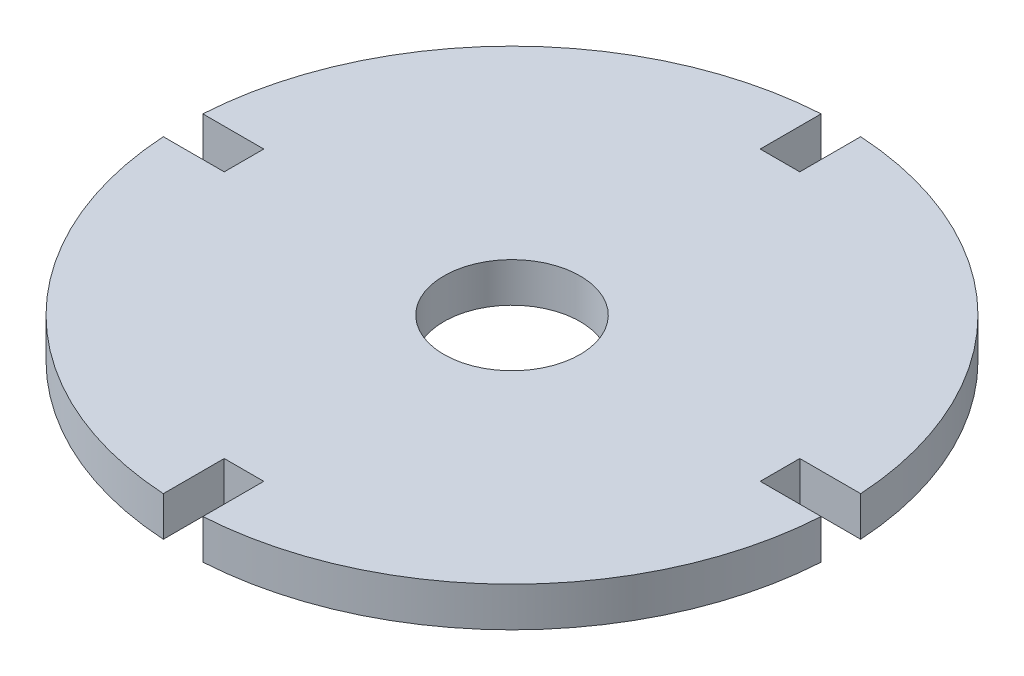
ISO-10303-21;
HEADER;
FILE_DESCRIPTION(('STEP AP214'),'2;1');
FILE_NAME('part.step','',(''),(''),'','','');
FILE_SCHEMA(('AUTOMOTIVE_DESIGN { 1 0 10303 214 1 1 1 1 }'));
ENDSEC;
DATA;
#1=APPLICATION_CONTEXT('core data for automotive mechanical design processes');
#2=APPLICATION_PROTOCOL_DEFINITION('international standard','automotive_design',2000,#1);
#3=PRODUCT_CONTEXT('',#1,'mechanical');
#4=PRODUCT('Part','Part','',(#3));
#5=PRODUCT_RELATED_PRODUCT_CATEGORY('part','',(#4));
#6=PRODUCT_DEFINITION_FORMATION('','',#4);
#7=PRODUCT_DEFINITION_CONTEXT('part definition',#1,'design');
#8=PRODUCT_DEFINITION('design','',#6,#7);
#9=PRODUCT_DEFINITION_SHAPE('','',#8);
#10=(LENGTH_UNIT() NAMED_UNIT(*) SI_UNIT(.MILLI.,.METRE.));
#11=(NAMED_UNIT(*) PLANE_ANGLE_UNIT() SI_UNIT($,.RADIAN.));
#12=(NAMED_UNIT(*) SI_UNIT($,.STERADIAN.) SOLID_ANGLE_UNIT());
#13=UNCERTAINTY_MEASURE_WITH_UNIT(LENGTH_MEASURE(1.E-05),#10,'distance_accuracy_value','');
#14=(GEOMETRIC_REPRESENTATION_CONTEXT(3) GLOBAL_UNCERTAINTY_ASSIGNED_CONTEXT((#13)) GLOBAL_UNIT_ASSIGNED_CONTEXT((#10,
#11,#12)) REPRESENTATION_CONTEXT('',''));
#15=CARTESIAN_POINT('',(0.,0.,0.));
#16=DIRECTION('',(0.,0.,1.));
#17=DIRECTION('',(1.,0.,0.));
#18=AXIS2_PLACEMENT_3D('',#15,#16,#17);
#19=CARTESIAN_POINT('',(0.,9.,0.));
#20=DIRECTION('',(0.,-1.,0.));
#21=DIRECTION('',(0.,0.,-1.));
#22=AXIS2_PLACEMENT_3D('',#19,#20,#21);
#23=CYLINDRICAL_SURFACE('',#22,75.);
#24=DIRECTION('',(0.,1.,0.));
#25=VECTOR('',#24,1.);
#26=CARTESIAN_POINT('',(-74.8648782808067,-0.000999999999999265,-4.5));
#27=LINE('',#26,#25);
#28=CARTESIAN_POINT('',(-74.8648782808067,0.,-4.5));
#29=VERTEX_POINT('',#28);
#30=CARTESIAN_POINT('',(-74.8648782808067,9.,-4.5));
#31=VERTEX_POINT('',#30);
#32=EDGE_CURVE('E165',#29,#31,#27,.T.);
#33=ORIENTED_EDGE('',*,*,#32,.T.);
#34=CARTESIAN_POINT('',(0.,9.,0.));
#35=DIRECTION('',(0.,1.,0.));
#36=DIRECTION('',(0.,0.,1.));
#37=AXIS2_PLACEMENT_3D('',#34,#35,#36);
#38=CIRCLE('',#37,75.);
#39=CARTESIAN_POINT('',(-4.5,9.,-74.8648782808067));
#40=VERTEX_POINT('',#39);
#41=EDGE_CURVE('E11',#40,#31,#38,.T.);
#42=ORIENTED_EDGE('',*,*,#41,.F.);
#43=DIRECTION('',(0.,1.,0.));
#44=VECTOR('',#43,1.);
#45=CARTESIAN_POINT('',(-4.5,-0.000999999999999265,-74.8648782808067));
#46=LINE('',#45,#44);
#47=CARTESIAN_POINT('',(-4.5,0.,-74.8648782808067));
#48=VERTEX_POINT('',#47);
#49=EDGE_CURVE('E197',#48,#40,#46,.T.);
#50=ORIENTED_EDGE('',*,*,#49,.F.);
#51=CARTESIAN_POINT('',(0.,0.,0.));
#52=DIRECTION('',(0.,1.,0.));
#53=DIRECTION('',(0.,0.,1.));
#54=AXIS2_PLACEMENT_3D('',#51,#52,#53);
#55=CIRCLE('',#54,75.);
#56=EDGE_CURVE('E37',#48,#29,#55,.T.);
#57=ORIENTED_EDGE('',*,*,#56,.T.);
#58=EDGE_LOOP('',(#33,#42,#50,#57));
#59=FACE_BOUND('',#58,.T.);
#60=ADVANCED_FACE('F33',(#59),#23,.T.);
#61=CARTESIAN_POINT('',(0.,9.,0.));
#62=DIRECTION('',(0.,1.,0.));
#63=DIRECTION('',(0.,0.,1.));
#64=AXIS2_PLACEMENT_3D('',#61,#62,#63);
#65=PLANE('',#64);
#66=DIRECTION('',(1.,0.,0.));
#67=VECTOR('',#66,1.);
#68=CARTESIAN_POINT('',(0.,9.,4.5));
#69=LINE('',#68,#67);
#70=CARTESIAN_POINT('',(-74.8648782808067,9.,4.5));
#71=VERTEX_POINT('',#70);
#72=CARTESIAN_POINT('',(-61.,9.,4.5));
#73=VERTEX_POINT('',#72);
#74=EDGE_CURVE('E272',#71,#73,#69,.T.);
#75=ORIENTED_EDGE('',*,*,#74,.F.);
#76=CARTESIAN_POINT('',(-4.49999999999998,9.,74.8648782808067));
#77=VERTEX_POINT('',#76);
#78=EDGE_CURVE('E42',#71,#77,#38,.T.);
#79=ORIENTED_EDGE('',*,*,#78,.T.);
#80=DIRECTION('',(0.,0.,1.));
#81=VECTOR('',#80,1.);
#82=CARTESIAN_POINT('',(-4.49999999999999,9.,0.));
#83=LINE('',#82,#81);
#84=CARTESIAN_POINT('',(-4.49999999999999,9.,61.));
#85=VERTEX_POINT('',#84);
#86=EDGE_CURVE('E257',#85,#77,#83,.T.);
#87=ORIENTED_EDGE('',*,*,#86,.F.);
#88=DIRECTION('',(1.,0.,0.));
#89=VECTOR('',#88,1.);
#90=CARTESIAN_POINT('',(0.,9.,61.));
#91=LINE('',#90,#89);
#92=CARTESIAN_POINT('',(4.50000000000001,9.,61.));
#93=VERTEX_POINT('',#92);
#94=EDGE_CURVE('E259',#85,#93,#91,.T.);
#95=ORIENTED_EDGE('',*,*,#94,.T.);
#96=DIRECTION('',(0.,0.,1.));
#97=VECTOR('',#96,1.);
#98=CARTESIAN_POINT('',(4.5,9.,0.));
#99=LINE('',#98,#97);
#100=CARTESIAN_POINT('',(4.50000000000002,9.,74.8648782808067));
#101=VERTEX_POINT('',#100);
#102=EDGE_CURVE('E250',#93,#101,#99,.T.);
#103=ORIENTED_EDGE('',*,*,#102,.T.);
#104=CARTESIAN_POINT('',(74.8648782808067,9.,4.5));
#105=VERTEX_POINT('',#104);
#106=EDGE_CURVE('E304',#101,#105,#38,.T.);
#107=ORIENTED_EDGE('',*,*,#106,.T.);
#108=DIRECTION('',(1.,0.,0.));
#109=VECTOR('',#108,1.);
#110=CARTESIAN_POINT('',(0.,9.,4.49999999999992));
#111=LINE('',#110,#109);
#112=CARTESIAN_POINT('',(61.,9.,4.49999999999998));
#113=VERTEX_POINT('',#112);
#114=EDGE_CURVE('E233',#113,#105,#111,.T.);
#115=ORIENTED_EDGE('',*,*,#114,.F.);
#116=DIRECTION('',(0.,0.,1.));
#117=VECTOR('',#116,1.);
#118=CARTESIAN_POINT('',(61.,9.,0.));
#119=LINE('',#118,#117);
#120=CARTESIAN_POINT('',(61.,9.,-4.50000000000001));
#121=VERTEX_POINT('',#120);
#122=EDGE_CURVE('E236',#121,#113,#119,.T.);
#123=ORIENTED_EDGE('',*,*,#122,.F.);
#124=DIRECTION('',(1.,0.,0.));
#125=VECTOR('',#124,1.);
#126=CARTESIAN_POINT('',(0.,9.,-4.50000000000008));
#127=LINE('',#126,#125);
#128=CARTESIAN_POINT('',(74.8648782808067,9.,-4.5));
#129=VERTEX_POINT('',#128);
#130=EDGE_CURVE('E226',#121,#129,#127,.T.);
#131=ORIENTED_EDGE('',*,*,#130,.T.);
#132=CARTESIAN_POINT('',(4.5,9.,-74.8648782808067));
#133=VERTEX_POINT('',#132);
#134=EDGE_CURVE('E43',#129,#133,#38,.T.);
#135=ORIENTED_EDGE('',*,*,#134,.T.);
#136=DIRECTION('',(0.,0.,1.));
#137=VECTOR('',#136,1.);
#138=CARTESIAN_POINT('',(4.50000000000008,9.,0.));
#139=LINE('',#138,#137);
#140=CARTESIAN_POINT('',(4.50000000000001,9.,-61.));
#141=VERTEX_POINT('',#140);
#142=EDGE_CURVE('E201',#133,#141,#139,.T.);
#143=ORIENTED_EDGE('',*,*,#142,.T.);
#144=DIRECTION('',(1.,0.,0.));
#145=VECTOR('',#144,1.);
#146=CARTESIAN_POINT('',(0.,9.,-61.));
#147=LINE('',#146,#145);
#148=CARTESIAN_POINT('',(-4.49999999999999,9.,-61.));
#149=VERTEX_POINT('',#148);
#150=EDGE_CURVE('E208',#149,#141,#147,.T.);
#151=ORIENTED_EDGE('',*,*,#150,.F.);
#152=DIRECTION('',(0.,0.,1.));
#153=VECTOR('',#152,1.);
#154=CARTESIAN_POINT('',(-4.49999999999991,9.,0.));
#155=LINE('',#154,#153);
#156=EDGE_CURVE('E211',#40,#149,#155,.T.);
#157=ORIENTED_EDGE('',*,*,#156,.F.);
#158=ORIENTED_EDGE('',*,*,#41,.T.);
#159=DIRECTION('',(1.,0.,0.));
#160=VECTOR('',#159,1.);
#161=CARTESIAN_POINT('',(0.,9.,-4.5));
#162=LINE('',#161,#160);
#163=CARTESIAN_POINT('',(-61.,9.,-4.5));
#164=VERTEX_POINT('',#163);
#165=EDGE_CURVE('E50',#31,#164,#162,.T.);
#166=ORIENTED_EDGE('',*,*,#165,.T.);
#167=DIRECTION('',(0.,0.,1.));
#168=VECTOR('',#167,1.);
#169=CARTESIAN_POINT('',(-61.,9.,0.));
#170=LINE('',#169,#168);
#171=EDGE_CURVE('E158',#164,#73,#170,.T.);
#172=ORIENTED_EDGE('',*,*,#171,.T.);
#173=EDGE_LOOP('',(#75,#79,#87,#95,#103,#107,#115,#123,#131,#135,#143,#151,#157,#158,#166,#172));
#174=FACE_BOUND('',#173,.T.);
#175=CARTESIAN_POINT('',(0.,9.,0.));
#176=DIRECTION('',(0.,1.,0.));
#177=DIRECTION('',(0.,0.,1.));
#178=AXIS2_PLACEMENT_3D('',#175,#176,#177);
#179=CIRCLE('',#178,15.5);
#180=CARTESIAN_POINT('',(0.,9.,15.5));
#181=VERTEX_POINT('',#180);
#182=EDGE_CURVE('E180',#181,#181,#179,.T.);
#183=ORIENTED_EDGE('',*,*,#182,.F.);
#184=EDGE_LOOP('',(#183));
#185=FACE_BOUND('',#184,.T.);
#186=ADVANCED_FACE('F289',(#174,#185),#65,.T.);
#187=CARTESIAN_POINT('',(0.,0.,0.));
#188=DIRECTION('',(0.,1.,0.));
#189=DIRECTION('',(0.,0.,1.));
#190=AXIS2_PLACEMENT_3D('',#187,#188,#189);
#191=PLANE('',#190);
#192=CARTESIAN_POINT('',(0.,0.,0.));
#193=DIRECTION('',(0.,1.,0.));
#194=DIRECTION('',(0.,0.,1.));
#195=AXIS2_PLACEMENT_3D('',#192,#193,#194);
#196=CIRCLE('',#195,15.5);
#197=CARTESIAN_POINT('',(0.,0.,15.5));
#198=VERTEX_POINT('',#197);
#199=EDGE_CURVE('E187',#198,#198,#196,.T.);
#200=ORIENTED_EDGE('',*,*,#199,.T.);
#201=EDGE_LOOP('',(#200));
#202=FACE_BOUND('',#201,.T.);
#203=CARTESIAN_POINT('',(-74.8648782808067,0.,4.5));
#204=VERTEX_POINT('',#203);
#205=CARTESIAN_POINT('',(-4.49999999999998,0.,74.8648782808067));
#206=VERTEX_POINT('',#205);
#207=EDGE_CURVE('E163',#204,#206,#55,.T.);
#208=ORIENTED_EDGE('',*,*,#207,.F.);
#209=DIRECTION('',(-1.,0.,0.));
#210=VECTOR('',#209,1.);
#211=CARTESIAN_POINT('',(0.,0.,4.5));
#212=LINE('',#211,#210);
#213=CARTESIAN_POINT('',(-61.,0.,4.5));
#214=VERTEX_POINT('',#213);
#215=EDGE_CURVE('E149',#214,#204,#212,.T.);
#216=ORIENTED_EDGE('',*,*,#215,.F.);
#217=DIRECTION('',(0.,0.,-1.));
#218=VECTOR('',#217,1.);
#219=CARTESIAN_POINT('',(-61.,0.,0.));
#220=LINE('',#219,#218);
#221=CARTESIAN_POINT('',(-61.,0.,-4.5));
#222=VERTEX_POINT('',#221);
#223=EDGE_CURVE('E159',#214,#222,#220,.T.);
#224=ORIENTED_EDGE('',*,*,#223,.T.);
#225=DIRECTION('',(-1.,0.,0.));
#226=VECTOR('',#225,1.);
#227=CARTESIAN_POINT('',(0.,0.,-4.5));
#228=LINE('',#227,#226);
#229=EDGE_CURVE('E267',#222,#29,#228,.T.);
#230=ORIENTED_EDGE('',*,*,#229,.T.);
#231=ORIENTED_EDGE('',*,*,#56,.F.);
#232=DIRECTION('',(0.,0.,-1.));
#233=VECTOR('',#232,1.);
#234=CARTESIAN_POINT('',(-4.49999999999991,0.,0.));
#235=LINE('',#234,#233);
#236=CARTESIAN_POINT('',(-4.49999999999999,0.,-61.));
#237=VERTEX_POINT('',#236);
#238=EDGE_CURVE('E214',#237,#48,#235,.T.);
#239=ORIENTED_EDGE('',*,*,#238,.F.);
#240=DIRECTION('',(-1.,0.,0.));
#241=VECTOR('',#240,1.);
#242=CARTESIAN_POINT('',(0.,0.,-61.));
#243=LINE('',#242,#241);
#244=CARTESIAN_POINT('',(4.50000000000001,0.,-61.));
#245=VERTEX_POINT('',#244);
#246=EDGE_CURVE('E192',#245,#237,#243,.T.);
#247=ORIENTED_EDGE('',*,*,#246,.F.);
#248=DIRECTION('',(0.,0.,-1.));
#249=VECTOR('',#248,1.);
#250=CARTESIAN_POINT('',(4.50000000000008,0.,0.));
#251=LINE('',#250,#249);
#252=CARTESIAN_POINT('',(4.5,0.,-74.8648782808067));
#253=VERTEX_POINT('',#252);
#254=EDGE_CURVE('E216',#245,#253,#251,.T.);
#255=ORIENTED_EDGE('',*,*,#254,.T.);
#256=CARTESIAN_POINT('',(74.8648782808067,0.,-4.5));
#257=VERTEX_POINT('',#256);
#258=EDGE_CURVE('E174',#257,#253,#55,.T.);
#259=ORIENTED_EDGE('',*,*,#258,.F.);
#260=DIRECTION('',(-1.,0.,0.));
#261=VECTOR('',#260,1.);
#262=CARTESIAN_POINT('',(0.,0.,-4.50000000000008));
#263=LINE('',#262,#261);
#264=CARTESIAN_POINT('',(61.,0.,-4.50000000000001));
#265=VERTEX_POINT('',#264);
#266=EDGE_CURVE('E239',#257,#265,#263,.T.);
#267=ORIENTED_EDGE('',*,*,#266,.T.);
#268=DIRECTION('',(0.,0.,-1.));
#269=VECTOR('',#268,1.);
#270=CARTESIAN_POINT('',(61.,0.,0.));
#271=LINE('',#270,#269);
#272=CARTESIAN_POINT('',(61.,0.,4.49999999999998));
#273=VERTEX_POINT('',#272);
#274=EDGE_CURVE('E242',#273,#265,#271,.T.);
#275=ORIENTED_EDGE('',*,*,#274,.F.);
#276=DIRECTION('',(-1.,0.,0.));
#277=VECTOR('',#276,1.);
#278=CARTESIAN_POINT('',(0.,0.,4.49999999999992));
#279=LINE('',#278,#277);
#280=CARTESIAN_POINT('',(74.8648782808067,0.,4.5));
#281=VERTEX_POINT('',#280);
#282=EDGE_CURVE('E219',#281,#273,#279,.T.);
#283=ORIENTED_EDGE('',*,*,#282,.F.);
#284=CARTESIAN_POINT('',(4.50000000000002,0.,74.8648782808067));
#285=VERTEX_POINT('',#284);
#286=EDGE_CURVE('E172',#285,#281,#55,.T.);
#287=ORIENTED_EDGE('',*,*,#286,.F.);
#288=DIRECTION('',(0.,0.,-1.));
#289=VECTOR('',#288,1.);
#290=CARTESIAN_POINT('',(4.5,0.,0.));
#291=LINE('',#290,#289);
#292=CARTESIAN_POINT('',(4.50000000000001,0.,61.));
#293=VERTEX_POINT('',#292);
#294=EDGE_CURVE('E262',#285,#293,#291,.T.);
#295=ORIENTED_EDGE('',*,*,#294,.T.);
#296=DIRECTION('',(-1.,0.,0.));
#297=VECTOR('',#296,1.);
#298=CARTESIAN_POINT('',(0.,0.,61.));
#299=LINE('',#298,#297);
#300=CARTESIAN_POINT('',(-4.49999999999999,0.,61.));
#301=VERTEX_POINT('',#300);
#302=EDGE_CURVE('E265',#293,#301,#299,.T.);
#303=ORIENTED_EDGE('',*,*,#302,.T.);
#304=DIRECTION('',(0.,0.,-1.));
#305=VECTOR('',#304,1.);
#306=CARTESIAN_POINT('',(-4.49999999999999,0.,0.));
#307=LINE('',#306,#305);
#308=EDGE_CURVE('E171',#206,#301,#307,.T.);
#309=ORIENTED_EDGE('',*,*,#308,.F.);
#310=EDGE_LOOP('',(#208,#216,#224,#230,#231,#239,#247,#255,#259,#267,#275,#283,#287,#295,#303,#309));
#311=FACE_BOUND('',#310,.T.);
#312=ADVANCED_FACE('F168',(#202,#311),#191,.F.);
#313=DIRECTION('',(0.,1.,0.));
#314=VECTOR('',#313,1.);
#315=CARTESIAN_POINT('',(4.50000000000002,-0.000999999999999265,74.8648782808067));
#316=LINE('',#315,#314);
#317=EDGE_CURVE('E252',#285,#101,#316,.T.);
#318=ORIENTED_EDGE('',*,*,#317,.F.);
#319=ORIENTED_EDGE('',*,*,#286,.T.);
#320=DIRECTION('',(0.,1.,0.));
#321=VECTOR('',#320,1.);
#322=CARTESIAN_POINT('',(74.8648782808067,-0.000999999999999265,4.5));
#323=LINE('',#322,#321);
#324=EDGE_CURVE('E225',#281,#105,#323,.T.);
#325=ORIENTED_EDGE('',*,*,#324,.T.);
#326=ORIENTED_EDGE('',*,*,#106,.F.);
#327=EDGE_LOOP('',(#318,#319,#325,#326));
#328=FACE_BOUND('',#327,.T.);
#329=ADVANCED_FACE('F312',(#328),#23,.T.);
#330=DIRECTION('',(0.,1.,0.));
#331=VECTOR('',#330,1.);
#332=CARTESIAN_POINT('',(74.8648782808067,-0.000999999999999265,-4.5));
#333=LINE('',#332,#331);
#334=EDGE_CURVE('E228',#257,#129,#333,.T.);
#335=ORIENTED_EDGE('',*,*,#334,.F.);
#336=ORIENTED_EDGE('',*,*,#258,.T.);
#337=DIRECTION('',(0.,1.,0.));
#338=VECTOR('',#337,1.);
#339=CARTESIAN_POINT('',(4.5,-0.000999999999999265,-74.8648782808067));
#340=LINE('',#339,#338);
#341=EDGE_CURVE('E203',#253,#133,#340,.T.);
#342=ORIENTED_EDGE('',*,*,#341,.T.);
#343=ORIENTED_EDGE('',*,*,#134,.F.);
#344=EDGE_LOOP('',(#335,#336,#342,#343));
#345=FACE_BOUND('',#344,.T.);
#346=ADVANCED_FACE('F303',(#345),#23,.T.);
#347=ORIENTED_EDGE('',*,*,#78,.F.);
#348=DIRECTION('',(0.,1.,0.));
#349=VECTOR('',#348,1.);
#350=CARTESIAN_POINT('',(-74.8648782808067,-0.000999999999999265,4.5));
#351=LINE('',#350,#349);
#352=EDGE_CURVE('E153',#204,#71,#351,.T.);
#353=ORIENTED_EDGE('',*,*,#352,.F.);
#354=ORIENTED_EDGE('',*,*,#207,.T.);
#355=DIRECTION('',(0.,1.,0.));
#356=VECTOR('',#355,1.);
#357=CARTESIAN_POINT('',(-4.49999999999998,-0.000999999999999265,74.8648782808067));
#358=LINE('',#357,#356);
#359=EDGE_CURVE('E249',#206,#77,#358,.T.);
#360=ORIENTED_EDGE('',*,*,#359,.T.);
#361=EDGE_LOOP('',(#347,#353,#354,#360));
#362=FACE_BOUND('',#361,.T.);
#363=ADVANCED_FACE('F35',(#362),#23,.T.);
#364=CARTESIAN_POINT('',(0.,9.,0.));
#365=DIRECTION('',(0.,-1.,0.));
#366=DIRECTION('',(0.,0.,-1.));
#367=AXIS2_PLACEMENT_3D('',#364,#365,#366);
#368=CYLINDRICAL_SURFACE('',#367,15.5);
#369=ORIENTED_EDGE('',*,*,#182,.T.);
#370=EDGE_LOOP('',(#369));
#371=FACE_BOUND('',#370,.T.);
#372=ORIENTED_EDGE('',*,*,#199,.F.);
#373=EDGE_LOOP('',(#372));
#374=FACE_BOUND('',#373,.T.);
#375=ADVANCED_FACE('F325',(#371,#374),#368,.F.);
#376=CARTESIAN_POINT('',(-4.49999999999991,-0.000999999999999265,0.));
#377=DIRECTION('',(-1.,0.,0.));
#378=DIRECTION('',(0.,0.,1.));
#379=AXIS2_PLACEMENT_3D('',#376,#377,#378);
#380=PLANE('',#379);
#381=ORIENTED_EDGE('',*,*,#238,.T.);
#382=ORIENTED_EDGE('',*,*,#49,.T.);
#383=ORIENTED_EDGE('',*,*,#156,.T.);
#384=DIRECTION('',(0.,1.,0.));
#385=VECTOR('',#384,1.);
#386=CARTESIAN_POINT('',(-4.49999999999999,-0.000999999999999265,-61.));
#387=LINE('',#386,#385);
#388=EDGE_CURVE('E198',#237,#149,#387,.T.);
#389=ORIENTED_EDGE('',*,*,#388,.F.);
#390=EDGE_LOOP('',(#381,#382,#383,#389));
#391=FACE_BOUND('',#390,.T.);
#392=ADVANCED_FACE('F293',(#391),#380,.F.);
#393=CARTESIAN_POINT('',(4.50000000000008,-0.000999999999999265,0.));
#394=DIRECTION('',(-1.,0.,0.));
#395=DIRECTION('',(0.,0.,1.));
#396=AXIS2_PLACEMENT_3D('',#393,#394,#395);
#397=PLANE('',#396);
#398=DIRECTION('',(0.,1.,0.));
#399=VECTOR('',#398,1.);
#400=CARTESIAN_POINT('',(4.50000000000001,-0.000999999999999265,-61.));
#401=LINE('',#400,#399);
#402=EDGE_CURVE('E200',#245,#141,#401,.T.);
#403=ORIENTED_EDGE('',*,*,#402,.T.);
#404=ORIENTED_EDGE('',*,*,#142,.F.);
#405=ORIENTED_EDGE('',*,*,#341,.F.);
#406=ORIENTED_EDGE('',*,*,#254,.F.);
#407=EDGE_LOOP('',(#403,#404,#405,#406));
#408=FACE_BOUND('',#407,.T.);
#409=ADVANCED_FACE('F301',(#408),#397,.T.);
#410=CARTESIAN_POINT('',(0.,-0.000999999999999265,-61.));
#411=DIRECTION('',(0.,0.,1.));
#412=DIRECTION('',(1.,0.,0.));
#413=AXIS2_PLACEMENT_3D('',#410,#411,#412);
#414=PLANE('',#413);
#415=ORIENTED_EDGE('',*,*,#246,.T.);
#416=ORIENTED_EDGE('',*,*,#388,.T.);
#417=ORIENTED_EDGE('',*,*,#150,.T.);
#418=ORIENTED_EDGE('',*,*,#402,.F.);
#419=EDGE_LOOP('',(#415,#416,#417,#418));
#420=FACE_BOUND('',#419,.T.);
#421=ADVANCED_FACE('F298',(#420),#414,.F.);
#422=CARTESIAN_POINT('',(61.,-0.000999999999999265,0.));
#423=DIRECTION('',(-1.,0.,0.));
#424=DIRECTION('',(0.,0.,1.));
#425=AXIS2_PLACEMENT_3D('',#422,#423,#424);
#426=PLANE('',#425);
#427=ORIENTED_EDGE('',*,*,#274,.T.);
#428=DIRECTION('',(0.,1.,0.));
#429=VECTOR('',#428,1.);
#430=CARTESIAN_POINT('',(61.,-0.000999999999999265,-4.50000000000001));
#431=LINE('',#430,#429);
#432=EDGE_CURVE('E222',#265,#121,#431,.T.);
#433=ORIENTED_EDGE('',*,*,#432,.T.);
#434=ORIENTED_EDGE('',*,*,#122,.T.);
#435=DIRECTION('',(0.,1.,0.));
#436=VECTOR('',#435,1.);
#437=CARTESIAN_POINT('',(61.,-0.000999999999999265,4.49999999999998));
#438=LINE('',#437,#436);
#439=EDGE_CURVE('E223',#273,#113,#438,.T.);
#440=ORIENTED_EDGE('',*,*,#439,.F.);
#441=EDGE_LOOP('',(#427,#433,#434,#440));
#442=FACE_BOUND('',#441,.T.);
#443=ADVANCED_FACE('F338',(#442),#426,.F.);
#444=CARTESIAN_POINT('',(0.,-0.000999999999999265,-4.50000000000008));
#445=DIRECTION('',(0.,0.,1.));
#446=DIRECTION('',(1.,0.,0.));
#447=AXIS2_PLACEMENT_3D('',#444,#445,#446);
#448=PLANE('',#447);
#449=ORIENTED_EDGE('',*,*,#334,.T.);
#450=ORIENTED_EDGE('',*,*,#130,.F.);
#451=ORIENTED_EDGE('',*,*,#432,.F.);
#452=ORIENTED_EDGE('',*,*,#266,.F.);
#453=EDGE_LOOP('',(#449,#450,#451,#452));
#454=FACE_BOUND('',#453,.T.);
#455=ADVANCED_FACE('F343',(#454),#448,.T.);
#456=CARTESIAN_POINT('',(0.,-0.000999999999999265,4.49999999999992));
#457=DIRECTION('',(0.,0.,1.));
#458=DIRECTION('',(1.,0.,0.));
#459=AXIS2_PLACEMENT_3D('',#456,#457,#458);
#460=PLANE('',#459);
#461=ORIENTED_EDGE('',*,*,#282,.T.);
#462=ORIENTED_EDGE('',*,*,#439,.T.);
#463=ORIENTED_EDGE('',*,*,#114,.T.);
#464=ORIENTED_EDGE('',*,*,#324,.F.);
#465=EDGE_LOOP('',(#461,#462,#463,#464));
#466=FACE_BOUND('',#465,.T.);
#467=ADVANCED_FACE('F310',(#466),#460,.F.);
#468=CARTESIAN_POINT('',(0.,-0.000999999999999265,61.));
#469=DIRECTION('',(0.,0.,1.));
#470=DIRECTION('',(1.,0.,0.));
#471=AXIS2_PLACEMENT_3D('',#468,#469,#470);
#472=PLANE('',#471);
#473=DIRECTION('',(0.,1.,0.));
#474=VECTOR('',#473,1.);
#475=CARTESIAN_POINT('',(4.50000000000001,-0.000999999999999265,61.));
#476=LINE('',#475,#474);
#477=EDGE_CURVE('E246',#293,#93,#476,.T.);
#478=ORIENTED_EDGE('',*,*,#477,.T.);
#479=ORIENTED_EDGE('',*,*,#94,.F.);
#480=DIRECTION('',(0.,1.,0.));
#481=VECTOR('',#480,1.);
#482=CARTESIAN_POINT('',(-4.49999999999999,-0.000999999999999265,61.));
#483=LINE('',#482,#481);
#484=EDGE_CURVE('E247',#301,#85,#483,.T.);
#485=ORIENTED_EDGE('',*,*,#484,.F.);
#486=ORIENTED_EDGE('',*,*,#302,.F.);
#487=EDGE_LOOP('',(#478,#479,#485,#486));
#488=FACE_BOUND('',#487,.T.);
#489=ADVANCED_FACE('F347',(#488),#472,.T.);
#490=CARTESIAN_POINT('',(4.5,-0.000999999999999265,0.));
#491=DIRECTION('',(-1.,0.,0.));
#492=DIRECTION('',(0.,0.,1.));
#493=AXIS2_PLACEMENT_3D('',#490,#491,#492);
#494=PLANE('',#493);
#495=ORIENTED_EDGE('',*,*,#317,.T.);
#496=ORIENTED_EDGE('',*,*,#102,.F.);
#497=ORIENTED_EDGE('',*,*,#477,.F.);
#498=ORIENTED_EDGE('',*,*,#294,.F.);
#499=EDGE_LOOP('',(#495,#496,#497,#498));
#500=FACE_BOUND('',#499,.T.);
#501=ADVANCED_FACE('F353',(#500),#494,.T.);
#502=CARTESIAN_POINT('',(-4.49999999999999,-0.000999999999999265,0.));
#503=DIRECTION('',(-1.,0.,0.));
#504=DIRECTION('',(0.,0.,1.));
#505=AXIS2_PLACEMENT_3D('',#502,#503,#504);
#506=PLANE('',#505);
#507=ORIENTED_EDGE('',*,*,#308,.T.);
#508=ORIENTED_EDGE('',*,*,#484,.T.);
#509=ORIENTED_EDGE('',*,*,#86,.T.);
#510=ORIENTED_EDGE('',*,*,#359,.F.);
#511=EDGE_LOOP('',(#507,#508,#509,#510));
#512=FACE_BOUND('',#511,.T.);
#513=ADVANCED_FACE('F355',(#512),#506,.F.);
#514=CARTESIAN_POINT('',(-61.,-0.000999999999999265,0.));
#515=DIRECTION('',(-1.,0.,0.));
#516=DIRECTION('',(0.,0.,1.));
#517=AXIS2_PLACEMENT_3D('',#514,#515,#516);
#518=PLANE('',#517);
#519=DIRECTION('',(0.,1.,0.));
#520=VECTOR('',#519,1.);
#521=CARTESIAN_POINT('',(-61.,-0.000999999999999265,4.5));
#522=LINE('',#521,#520);
#523=EDGE_CURVE('E154',#214,#73,#522,.T.);
#524=ORIENTED_EDGE('',*,*,#523,.T.);
#525=ORIENTED_EDGE('',*,*,#171,.F.);
#526=DIRECTION('',(0.,1.,0.));
#527=VECTOR('',#526,1.);
#528=CARTESIAN_POINT('',(-61.,-0.000999999999999265,-4.5));
#529=LINE('',#528,#527);
#530=EDGE_CURVE('E270',#222,#164,#529,.T.);
#531=ORIENTED_EDGE('',*,*,#530,.F.);
#532=ORIENTED_EDGE('',*,*,#223,.F.);
#533=EDGE_LOOP('',(#524,#525,#531,#532));
#534=FACE_BOUND('',#533,.T.);
#535=ADVANCED_FACE('F282',(#534),#518,.T.);
#536=CARTESIAN_POINT('',(0.,-0.000999999999999265,4.5));
#537=DIRECTION('',(0.,0.,1.));
#538=DIRECTION('',(1.,0.,0.));
#539=AXIS2_PLACEMENT_3D('',#536,#537,#538);
#540=PLANE('',#539);
#541=ORIENTED_EDGE('',*,*,#215,.T.);
#542=ORIENTED_EDGE('',*,*,#352,.T.);
#543=ORIENTED_EDGE('',*,*,#74,.T.);
#544=ORIENTED_EDGE('',*,*,#523,.F.);
#545=EDGE_LOOP('',(#541,#542,#543,#544));
#546=FACE_BOUND('',#545,.T.);
#547=ADVANCED_FACE('F151',(#546),#540,.F.);
#548=CARTESIAN_POINT('',(0.,-0.000999999999999265,-4.5));
#549=DIRECTION('',(0.,0.,1.));
#550=DIRECTION('',(1.,0.,0.));
#551=AXIS2_PLACEMENT_3D('',#548,#549,#550);
#552=PLANE('',#551);
#553=ORIENTED_EDGE('',*,*,#530,.T.);
#554=ORIENTED_EDGE('',*,*,#165,.F.);
#555=ORIENTED_EDGE('',*,*,#32,.F.);
#556=ORIENTED_EDGE('',*,*,#229,.F.);
#557=EDGE_LOOP('',(#553,#554,#555,#556));
#558=FACE_BOUND('',#557,.T.);
#559=ADVANCED_FACE('F284',(#558),#552,.T.);
#560=CLOSED_SHELL('',(#60,#186,#312,#329,#346,#363,#375,#392,#409,#421,#443,#455,#467,#489,#501,
#513,#535,#547,#559));
#561=MANIFOLD_SOLID_BREP('B2',#560);
#562=ADVANCED_BREP_SHAPE_REPRESENTATION('',(#18,#561),#14);
#563=SHAPE_DEFINITION_REPRESENTATION(#9,#562);
ENDSEC;
END-ISO-10303-21;
